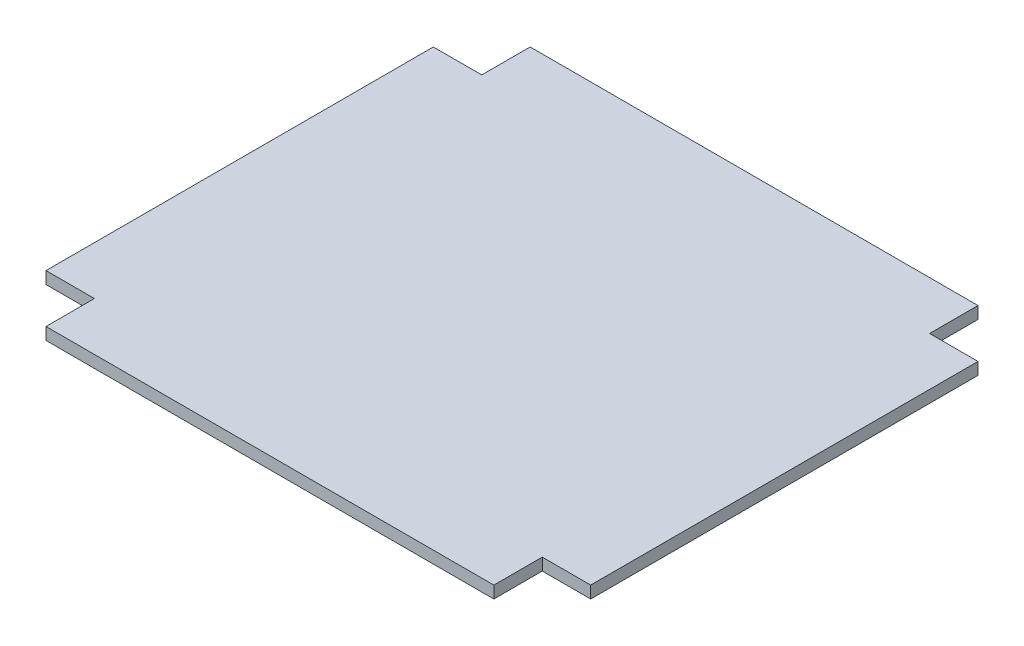
ISO-10303-21;
HEADER;
FILE_DESCRIPTION(('STEP AP214'),'2;1');
FILE_NAME('part.step','',(''),(''),'','','');
FILE_SCHEMA(('AUTOMOTIVE_DESIGN { 1 0 10303 214 1 1 1 1 }'));
ENDSEC;
DATA;
#1=APPLICATION_CONTEXT('core data for automotive mechanical design processes');
#2=APPLICATION_PROTOCOL_DEFINITION('international standard','automotive_design',2000,#1);
#3=PRODUCT_CONTEXT('',#1,'mechanical');
#4=PRODUCT('Part','Part','',(#3));
#5=PRODUCT_RELATED_PRODUCT_CATEGORY('part','',(#4));
#6=PRODUCT_DEFINITION_FORMATION('','',#4);
#7=PRODUCT_DEFINITION_CONTEXT('part definition',#1,'design');
#8=PRODUCT_DEFINITION('design','',#6,#7);
#9=PRODUCT_DEFINITION_SHAPE('','',#8);
#10=(LENGTH_UNIT() NAMED_UNIT(*) SI_UNIT(.MILLI.,.METRE.));
#11=(NAMED_UNIT(*) PLANE_ANGLE_UNIT() SI_UNIT($,.RADIAN.));
#12=(NAMED_UNIT(*) SI_UNIT($,.STERADIAN.) SOLID_ANGLE_UNIT());
#13=UNCERTAINTY_MEASURE_WITH_UNIT(LENGTH_MEASURE(1.E-05),#10,'distance_accuracy_value','');
#14=(GEOMETRIC_REPRESENTATION_CONTEXT(3) GLOBAL_UNCERTAINTY_ASSIGNED_CONTEXT((#13)) GLOBAL_UNIT_ASSIGNED_CONTEXT((#10,
#11,#12)) REPRESENTATION_CONTEXT('',''));
#15=CARTESIAN_POINT('',(0.,0.,0.));
#16=DIRECTION('',(0.,0.,1.));
#17=DIRECTION('',(1.,0.,0.));
#18=AXIS2_PLACEMENT_3D('',#15,#16,#17);
#19=CARTESIAN_POINT('',(120.65,6.35,0.));
#20=DIRECTION('',(1.,0.,0.));
#21=DIRECTION('',(0.,0.,-1.));
#22=AXIS2_PLACEMENT_3D('',#19,#20,#21);
#23=PLANE('',#22);
#24=DIRECTION('',(0.,0.,1.));
#25=VECTOR('',#24,1.);
#26=CARTESIAN_POINT('',(120.65,0.,0.));
#27=LINE('',#26,#25);
#28=CARTESIAN_POINT('',(120.65,0.,-127.));
#29=VERTEX_POINT('',#28);
#30=CARTESIAN_POINT('',(120.65,0.,-101.6));
#31=VERTEX_POINT('',#30);
#32=EDGE_CURVE('E152',#29,#31,#27,.T.);
#33=ORIENTED_EDGE('',*,*,#32,.F.);
#34=DIRECTION('',(0.,-1.,0.));
#35=VECTOR('',#34,1.);
#36=CARTESIAN_POINT('',(120.65,6.35,-127.));
#37=LINE('',#36,#35);
#38=CARTESIAN_POINT('',(120.65,6.35,-127.));
#39=VERTEX_POINT('',#38);
#40=EDGE_CURVE('E11',#39,#29,#37,.T.);
#41=ORIENTED_EDGE('',*,*,#40,.F.);
#42=DIRECTION('',(0.,0.,1.));
#43=VECTOR('',#42,1.);
#44=CARTESIAN_POINT('',(120.65,6.35,0.));
#45=LINE('',#44,#43);
#46=CARTESIAN_POINT('',(120.65,6.35,-101.6));
#47=VERTEX_POINT('',#46);
#48=EDGE_CURVE('E182',#39,#47,#45,.T.);
#49=ORIENTED_EDGE('',*,*,#48,.T.);
#50=DIRECTION('',(0.,-1.,0.));
#51=VECTOR('',#50,1.);
#52=CARTESIAN_POINT('',(120.65,6.35,-101.6));
#53=LINE('',#52,#51);
#54=EDGE_CURVE('E98',#47,#31,#53,.T.);
#55=ORIENTED_EDGE('',*,*,#54,.T.);
#56=EDGE_LOOP('',(#33,#41,#49,#55));
#57=FACE_BOUND('',#56,.T.);
#58=ADVANCED_FACE('F36',(#57),#23,.T.);
#59=CARTESIAN_POINT('',(0.,6.35,-127.));
#60=DIRECTION('',(0.,0.,-1.));
#61=DIRECTION('',(-1.,0.,0.));
#62=AXIS2_PLACEMENT_3D('',#59,#60,#61);
#63=PLANE('',#62);
#64=DIRECTION('',(1.,0.,0.));
#65=VECTOR('',#64,1.);
#66=CARTESIAN_POINT('',(0.,0.,-127.));
#67=LINE('',#66,#65);
#68=CARTESIAN_POINT('',(-114.3,0.,-127.));
#69=VERTEX_POINT('',#68);
#70=EDGE_CURVE('E155',#69,#29,#67,.T.);
#71=ORIENTED_EDGE('',*,*,#70,.F.);
#72=DIRECTION('',(0.,-1.,0.));
#73=VECTOR('',#72,1.);
#74=CARTESIAN_POINT('',(-114.3,6.35,-127.));
#75=LINE('',#74,#73);
#76=CARTESIAN_POINT('',(-114.3,6.35,-127.));
#77=VERTEX_POINT('',#76);
#78=EDGE_CURVE('E44',#77,#69,#75,.T.);
#79=ORIENTED_EDGE('',*,*,#78,.F.);
#80=DIRECTION('',(1.,0.,0.));
#81=VECTOR('',#80,1.);
#82=CARTESIAN_POINT('',(0.,6.35,-127.));
#83=LINE('',#82,#81);
#84=EDGE_CURVE('E214',#77,#39,#83,.T.);
#85=ORIENTED_EDGE('',*,*,#84,.T.);
#86=ORIENTED_EDGE('',*,*,#40,.T.);
#87=EDGE_LOOP('',(#71,#79,#85,#86));
#88=FACE_BOUND('',#87,.T.);
#89=ADVANCED_FACE('F213',(#88),#63,.T.);
#90=CARTESIAN_POINT('',(-114.3,6.35,0.));
#91=DIRECTION('',(1.,0.,0.));
#92=DIRECTION('',(0.,0.,-1.));
#93=AXIS2_PLACEMENT_3D('',#90,#91,#92);
#94=PLANE('',#93);
#95=DIRECTION('',(0.,0.,1.));
#96=VECTOR('',#95,1.);
#97=CARTESIAN_POINT('',(-114.3,0.,0.));
#98=LINE('',#97,#96);
#99=CARTESIAN_POINT('',(-114.3,0.,-101.6));
#100=VERTEX_POINT('',#99);
#101=EDGE_CURVE('E158',#69,#100,#98,.T.);
#102=ORIENTED_EDGE('',*,*,#101,.T.);
#103=DIRECTION('',(0.,-1.,0.));
#104=VECTOR('',#103,1.);
#105=CARTESIAN_POINT('',(-114.3,6.35,-101.6));
#106=LINE('',#105,#104);
#107=CARTESIAN_POINT('',(-114.3,6.35,-101.6));
#108=VERTEX_POINT('',#107);
#109=EDGE_CURVE('E198',#108,#100,#106,.T.);
#110=ORIENTED_EDGE('',*,*,#109,.F.);
#111=DIRECTION('',(0.,0.,1.));
#112=VECTOR('',#111,1.);
#113=CARTESIAN_POINT('',(-114.3,6.35,0.));
#114=LINE('',#113,#112);
#115=EDGE_CURVE('E204',#77,#108,#114,.T.);
#116=ORIENTED_EDGE('',*,*,#115,.F.);
#117=ORIENTED_EDGE('',*,*,#78,.T.);
#118=EDGE_LOOP('',(#102,#110,#116,#117));
#119=FACE_BOUND('',#118,.T.);
#120=ADVANCED_FACE('F202',(#119),#94,.F.);
#121=CARTESIAN_POINT('',(0.,6.35,-101.6));
#122=DIRECTION('',(0.,0.,-1.));
#123=DIRECTION('',(-1.,0.,0.));
#124=AXIS2_PLACEMENT_3D('',#121,#122,#123);
#125=PLANE('',#124);
#126=DIRECTION('',(1.,0.,0.));
#127=VECTOR('',#126,1.);
#128=CARTESIAN_POINT('',(0.,0.,-101.6));
#129=LINE('',#128,#127);
#130=CARTESIAN_POINT('',(-139.7,0.,-101.6));
#131=VERTEX_POINT('',#130);
#132=EDGE_CURVE('E161',#131,#100,#129,.T.);
#133=ORIENTED_EDGE('',*,*,#132,.F.);
#134=DIRECTION('',(0.,-1.,0.));
#135=VECTOR('',#134,1.);
#136=CARTESIAN_POINT('',(-139.7,6.35,-101.6));
#137=LINE('',#136,#135);
#138=CARTESIAN_POINT('',(-139.7,6.35,-101.6));
#139=VERTEX_POINT('',#138);
#140=EDGE_CURVE('E196',#139,#131,#137,.T.);
#141=ORIENTED_EDGE('',*,*,#140,.F.);
#142=DIRECTION('',(1.,0.,0.));
#143=VECTOR('',#142,1.);
#144=CARTESIAN_POINT('',(0.,6.35,-101.6));
#145=LINE('',#144,#143);
#146=EDGE_CURVE('E220',#139,#108,#145,.T.);
#147=ORIENTED_EDGE('',*,*,#146,.T.);
#148=ORIENTED_EDGE('',*,*,#109,.T.);
#149=EDGE_LOOP('',(#133,#141,#147,#148));
#150=FACE_BOUND('',#149,.T.);
#151=ADVANCED_FACE('F251',(#150),#125,.T.);
#152=CARTESIAN_POINT('',(-139.7,6.35,0.));
#153=DIRECTION('',(1.,0.,0.));
#154=DIRECTION('',(0.,0.,-1.));
#155=AXIS2_PLACEMENT_3D('',#152,#153,#154);
#156=PLANE('',#155);
#157=DIRECTION('',(0.,0.,1.));
#158=VECTOR('',#157,1.);
#159=CARTESIAN_POINT('',(-139.7,0.,0.));
#160=LINE('',#159,#158);
#161=CARTESIAN_POINT('',(-139.7,0.,101.6));
#162=VERTEX_POINT('',#161);
#163=EDGE_CURVE('E164',#131,#162,#160,.T.);
#164=ORIENTED_EDGE('',*,*,#163,.T.);
#165=DIRECTION('',(0.,-1.,0.));
#166=VECTOR('',#165,1.);
#167=CARTESIAN_POINT('',(-139.7,6.35,101.6));
#168=LINE('',#167,#166);
#169=CARTESIAN_POINT('',(-139.7,6.35,101.6));
#170=VERTEX_POINT('',#169);
#171=EDGE_CURVE('E193',#170,#162,#168,.T.);
#172=ORIENTED_EDGE('',*,*,#171,.F.);
#173=DIRECTION('',(0.,0.,1.));
#174=VECTOR('',#173,1.);
#175=CARTESIAN_POINT('',(-139.7,6.35,0.));
#176=LINE('',#175,#174);
#177=EDGE_CURVE('E223',#139,#170,#176,.T.);
#178=ORIENTED_EDGE('',*,*,#177,.F.);
#179=ORIENTED_EDGE('',*,*,#140,.T.);
#180=EDGE_LOOP('',(#164,#172,#178,#179));
#181=FACE_BOUND('',#180,.T.);
#182=ADVANCED_FACE('F254',(#181),#156,.F.);
#183=CARTESIAN_POINT('',(0.,6.35,101.6));
#184=DIRECTION('',(0.,0.,-1.));
#185=DIRECTION('',(-1.,0.,0.));
#186=AXIS2_PLACEMENT_3D('',#183,#184,#185);
#187=PLANE('',#186);
#188=DIRECTION('',(1.,0.,0.));
#189=VECTOR('',#188,1.);
#190=CARTESIAN_POINT('',(0.,0.,101.6));
#191=LINE('',#190,#189);
#192=CARTESIAN_POINT('',(-114.3,0.,101.6));
#193=VERTEX_POINT('',#192);
#194=EDGE_CURVE('E166',#162,#193,#191,.T.);
#195=ORIENTED_EDGE('',*,*,#194,.T.);
#196=DIRECTION('',(0.,-1.,0.));
#197=VECTOR('',#196,1.);
#198=CARTESIAN_POINT('',(-114.3,6.35,101.6));
#199=LINE('',#198,#197);
#200=CARTESIAN_POINT('',(-114.3,6.35,101.6));
#201=VERTEX_POINT('',#200);
#202=EDGE_CURVE('E191',#201,#193,#199,.T.);
#203=ORIENTED_EDGE('',*,*,#202,.F.);
#204=DIRECTION('',(1.,0.,0.));
#205=VECTOR('',#204,1.);
#206=CARTESIAN_POINT('',(0.,6.35,101.6));
#207=LINE('',#206,#205);
#208=EDGE_CURVE('E225',#170,#201,#207,.T.);
#209=ORIENTED_EDGE('',*,*,#208,.F.);
#210=ORIENTED_EDGE('',*,*,#171,.T.);
#211=EDGE_LOOP('',(#195,#203,#209,#210));
#212=FACE_BOUND('',#211,.T.);
#213=ADVANCED_FACE('F247',(#212),#187,.F.);
#214=CARTESIAN_POINT('',(-114.3,6.35,0.));
#215=DIRECTION('',(-1.,0.,0.));
#216=DIRECTION('',(0.,0.,1.));
#217=AXIS2_PLACEMENT_3D('',#214,#215,#216);
#218=PLANE('',#217);
#219=DIRECTION('',(0.,0.,-1.));
#220=VECTOR('',#219,1.);
#221=CARTESIAN_POINT('',(-114.3,0.,0.));
#222=LINE('',#221,#220);
#223=CARTESIAN_POINT('',(-114.3,0.,127.));
#224=VERTEX_POINT('',#223);
#225=EDGE_CURVE('E169',#224,#193,#222,.T.);
#226=ORIENTED_EDGE('',*,*,#225,.F.);
#227=DIRECTION('',(0.,-1.,0.));
#228=VECTOR('',#227,1.);
#229=CARTESIAN_POINT('',(-114.3,6.35,127.));
#230=LINE('',#229,#228);
#231=CARTESIAN_POINT('',(-114.3,6.35,127.));
#232=VERTEX_POINT('',#231);
#233=EDGE_CURVE('E189',#232,#224,#230,.T.);
#234=ORIENTED_EDGE('',*,*,#233,.F.);
#235=DIRECTION('',(0.,0.,-1.));
#236=VECTOR('',#235,1.);
#237=CARTESIAN_POINT('',(-114.3,6.35,0.));
#238=LINE('',#237,#236);
#239=EDGE_CURVE('E227',#232,#201,#238,.T.);
#240=ORIENTED_EDGE('',*,*,#239,.T.);
#241=ORIENTED_EDGE('',*,*,#202,.T.);
#242=EDGE_LOOP('',(#226,#234,#240,#241));
#243=FACE_BOUND('',#242,.T.);
#244=ADVANCED_FACE('F243',(#243),#218,.T.);
#245=CARTESIAN_POINT('',(0.,6.35,127.));
#246=DIRECTION('',(0.,0.,-1.));
#247=DIRECTION('',(-1.,0.,0.));
#248=AXIS2_PLACEMENT_3D('',#245,#246,#247);
#249=PLANE('',#248);
#250=DIRECTION('',(1.,0.,0.));
#251=VECTOR('',#250,1.);
#252=CARTESIAN_POINT('',(0.,0.,127.));
#253=LINE('',#252,#251);
#254=CARTESIAN_POINT('',(120.65,0.,127.));
#255=VERTEX_POINT('',#254);
#256=EDGE_CURVE('E172',#224,#255,#253,.T.);
#257=ORIENTED_EDGE('',*,*,#256,.T.);
#258=DIRECTION('',(0.,-1.,0.));
#259=VECTOR('',#258,1.);
#260=CARTESIAN_POINT('',(120.65,6.35,127.));
#261=LINE('',#260,#259);
#262=CARTESIAN_POINT('',(120.65,6.35,127.));
#263=VERTEX_POINT('',#262);
#264=EDGE_CURVE('E186',#263,#255,#261,.T.);
#265=ORIENTED_EDGE('',*,*,#264,.F.);
#266=DIRECTION('',(1.,0.,0.));
#267=VECTOR('',#266,1.);
#268=CARTESIAN_POINT('',(0.,6.35,127.));
#269=LINE('',#268,#267);
#270=EDGE_CURVE('E230',#232,#263,#269,.T.);
#271=ORIENTED_EDGE('',*,*,#270,.F.);
#272=ORIENTED_EDGE('',*,*,#233,.T.);
#273=EDGE_LOOP('',(#257,#265,#271,#272));
#274=FACE_BOUND('',#273,.T.);
#275=ADVANCED_FACE('F235',(#274),#249,.F.);
#276=CARTESIAN_POINT('',(120.65,6.35,0.));
#277=DIRECTION('',(-1.,0.,0.));
#278=DIRECTION('',(0.,0.,1.));
#279=AXIS2_PLACEMENT_3D('',#276,#277,#278);
#280=PLANE('',#279);
#281=DIRECTION('',(0.,0.,-1.));
#282=VECTOR('',#281,1.);
#283=CARTESIAN_POINT('',(120.65,0.,0.));
#284=LINE('',#283,#282);
#285=CARTESIAN_POINT('',(120.65,0.,101.6));
#286=VERTEX_POINT('',#285);
#287=EDGE_CURVE('E174',#255,#286,#284,.T.);
#288=ORIENTED_EDGE('',*,*,#287,.T.);
#289=DIRECTION('',(0.,-1.,0.));
#290=VECTOR('',#289,1.);
#291=CARTESIAN_POINT('',(120.65,6.35,101.6));
#292=LINE('',#291,#290);
#293=CARTESIAN_POINT('',(120.65,6.35,101.6));
#294=VERTEX_POINT('',#293);
#295=EDGE_CURVE('E139',#294,#286,#292,.T.);
#296=ORIENTED_EDGE('',*,*,#295,.F.);
#297=DIRECTION('',(0.,0.,-1.));
#298=VECTOR('',#297,1.);
#299=CARTESIAN_POINT('',(120.65,6.35,0.));
#300=LINE('',#299,#298);
#301=EDGE_CURVE('E144',#263,#294,#300,.T.);
#302=ORIENTED_EDGE('',*,*,#301,.F.);
#303=ORIENTED_EDGE('',*,*,#264,.T.);
#304=EDGE_LOOP('',(#288,#296,#302,#303));
#305=FACE_BOUND('',#304,.T.);
#306=ADVANCED_FACE('F239',(#305),#280,.F.);
#307=CARTESIAN_POINT('',(0.,6.35,101.6));
#308=DIRECTION('',(0.,0.,1.));
#309=DIRECTION('',(1.,0.,0.));
#310=AXIS2_PLACEMENT_3D('',#307,#308,#309);
#311=PLANE('',#310);
#312=DIRECTION('',(-1.,0.,0.));
#313=VECTOR('',#312,1.);
#314=CARTESIAN_POINT('',(0.,0.,101.6));
#315=LINE('',#314,#313);
#316=CARTESIAN_POINT('',(146.05,0.,101.6));
#317=VERTEX_POINT('',#316);
#318=EDGE_CURVE('E134',#317,#286,#315,.T.);
#319=ORIENTED_EDGE('',*,*,#318,.F.);
#320=DIRECTION('',(0.,-1.,0.));
#321=VECTOR('',#320,1.);
#322=CARTESIAN_POINT('',(146.05,6.35,101.6));
#323=LINE('',#322,#321);
#324=CARTESIAN_POINT('',(146.05,6.35,101.6));
#325=VERTEX_POINT('',#324);
#326=EDGE_CURVE('E129',#325,#317,#323,.T.);
#327=ORIENTED_EDGE('',*,*,#326,.F.);
#328=DIRECTION('',(-1.,0.,0.));
#329=VECTOR('',#328,1.);
#330=CARTESIAN_POINT('',(0.,6.35,101.6));
#331=LINE('',#330,#329);
#332=EDGE_CURVE('E132',#325,#294,#331,.T.);
#333=ORIENTED_EDGE('',*,*,#332,.T.);
#334=ORIENTED_EDGE('',*,*,#295,.T.);
#335=EDGE_LOOP('',(#319,#327,#333,#334));
#336=FACE_BOUND('',#335,.T.);
#337=ADVANCED_FACE('F131',(#336),#311,.T.);
#338=CARTESIAN_POINT('',(146.05,6.35,0.));
#339=DIRECTION('',(1.,0.,0.));
#340=DIRECTION('',(0.,0.,-1.));
#341=AXIS2_PLACEMENT_3D('',#338,#339,#340);
#342=PLANE('',#341);
#343=DIRECTION('',(0.,0.,1.));
#344=VECTOR('',#343,1.);
#345=CARTESIAN_POINT('',(146.05,0.,0.));
#346=LINE('',#345,#344);
#347=CARTESIAN_POINT('',(146.05,0.,-101.6));
#348=VERTEX_POINT('',#347);
#349=EDGE_CURVE('E178',#348,#317,#346,.T.);
#350=ORIENTED_EDGE('',*,*,#349,.F.);
#351=DIRECTION('',(0.,-1.,0.));
#352=VECTOR('',#351,1.);
#353=CARTESIAN_POINT('',(146.05,6.35,-101.6));
#354=LINE('',#353,#352);
#355=CARTESIAN_POINT('',(146.05,6.35,-101.6));
#356=VERTEX_POINT('',#355);
#357=EDGE_CURVE('E91',#356,#348,#354,.T.);
#358=ORIENTED_EDGE('',*,*,#357,.F.);
#359=DIRECTION('',(0.,0.,1.));
#360=VECTOR('',#359,1.);
#361=CARTESIAN_POINT('',(146.05,6.35,0.));
#362=LINE('',#361,#360);
#363=EDGE_CURVE('E142',#356,#325,#362,.T.);
#364=ORIENTED_EDGE('',*,*,#363,.T.);
#365=ORIENTED_EDGE('',*,*,#326,.T.);
#366=EDGE_LOOP('',(#350,#358,#364,#365));
#367=FACE_BOUND('',#366,.T.);
#368=ADVANCED_FACE('F147',(#367),#342,.T.);
#369=CARTESIAN_POINT('',(0.,6.35,-101.6));
#370=DIRECTION('',(0.,0.,1.));
#371=DIRECTION('',(1.,0.,0.));
#372=AXIS2_PLACEMENT_3D('',#369,#370,#371);
#373=PLANE('',#372);
#374=DIRECTION('',(-1.,0.,0.));
#375=VECTOR('',#374,1.);
#376=CARTESIAN_POINT('',(0.,0.,-101.6));
#377=LINE('',#376,#375);
#378=EDGE_CURVE('E180',#348,#31,#377,.T.);
#379=ORIENTED_EDGE('',*,*,#378,.T.);
#380=ORIENTED_EDGE('',*,*,#54,.F.);
#381=DIRECTION('',(-1.,0.,0.));
#382=VECTOR('',#381,1.);
#383=CARTESIAN_POINT('',(0.,6.35,-101.6));
#384=LINE('',#383,#382);
#385=EDGE_CURVE('E52',#356,#47,#384,.T.);
#386=ORIENTED_EDGE('',*,*,#385,.F.);
#387=ORIENTED_EDGE('',*,*,#357,.T.);
#388=EDGE_LOOP('',(#379,#380,#386,#387));
#389=FACE_BOUND('',#388,.T.);
#390=ADVANCED_FACE('F215',(#389),#373,.F.);
#391=CARTESIAN_POINT('',(0.,6.35,0.));
#392=DIRECTION('',(0.,1.,0.));
#393=DIRECTION('',(0.,0.,1.));
#394=AXIS2_PLACEMENT_3D('',#391,#392,#393);
#395=PLANE('',#394);
#396=ORIENTED_EDGE('',*,*,#48,.F.);
#397=ORIENTED_EDGE('',*,*,#84,.F.);
#398=ORIENTED_EDGE('',*,*,#115,.T.);
#399=ORIENTED_EDGE('',*,*,#146,.F.);
#400=ORIENTED_EDGE('',*,*,#177,.T.);
#401=ORIENTED_EDGE('',*,*,#208,.T.);
#402=ORIENTED_EDGE('',*,*,#239,.F.);
#403=ORIENTED_EDGE('',*,*,#270,.T.);
#404=ORIENTED_EDGE('',*,*,#301,.T.);
#405=ORIENTED_EDGE('',*,*,#332,.F.);
#406=ORIENTED_EDGE('',*,*,#363,.F.);
#407=ORIENTED_EDGE('',*,*,#385,.T.);
#408=EDGE_LOOP('',(#396,#397,#398,#399,#400,#401,#402,#403,#404,#405,#406,#407));
#409=FACE_BOUND('',#408,.T.);
#410=ADVANCED_FACE('F141',(#409),#395,.T.);
#411=CARTESIAN_POINT('',(0.,0.,0.));
#412=DIRECTION('',(0.,1.,0.));
#413=DIRECTION('',(0.,0.,1.));
#414=AXIS2_PLACEMENT_3D('',#411,#412,#413);
#415=PLANE('',#414);
#416=ORIENTED_EDGE('',*,*,#32,.T.);
#417=ORIENTED_EDGE('',*,*,#378,.F.);
#418=ORIENTED_EDGE('',*,*,#349,.T.);
#419=ORIENTED_EDGE('',*,*,#318,.T.);
#420=ORIENTED_EDGE('',*,*,#287,.F.);
#421=ORIENTED_EDGE('',*,*,#256,.F.);
#422=ORIENTED_EDGE('',*,*,#225,.T.);
#423=ORIENTED_EDGE('',*,*,#194,.F.);
#424=ORIENTED_EDGE('',*,*,#163,.F.);
#425=ORIENTED_EDGE('',*,*,#132,.T.);
#426=ORIENTED_EDGE('',*,*,#101,.F.);
#427=ORIENTED_EDGE('',*,*,#70,.T.);
#428=EDGE_LOOP('',(#416,#417,#418,#419,#420,#421,#422,#423,#424,#425,#426,#427));
#429=FACE_BOUND('',#428,.T.);
#430=ADVANCED_FACE('F210',(#429),#415,.F.);
#431=CLOSED_SHELL('',(#58,#89,#120,#151,#182,#213,#244,#275,#306,#337,#368,#390,#410,#430));
#432=MANIFOLD_SOLID_BREP('B2',#431);
#433=ADVANCED_BREP_SHAPE_REPRESENTATION('',(#18,#432),#14);
#434=SHAPE_DEFINITION_REPRESENTATION(#9,#433);
ENDSEC;
END-ISO-10303-21;
